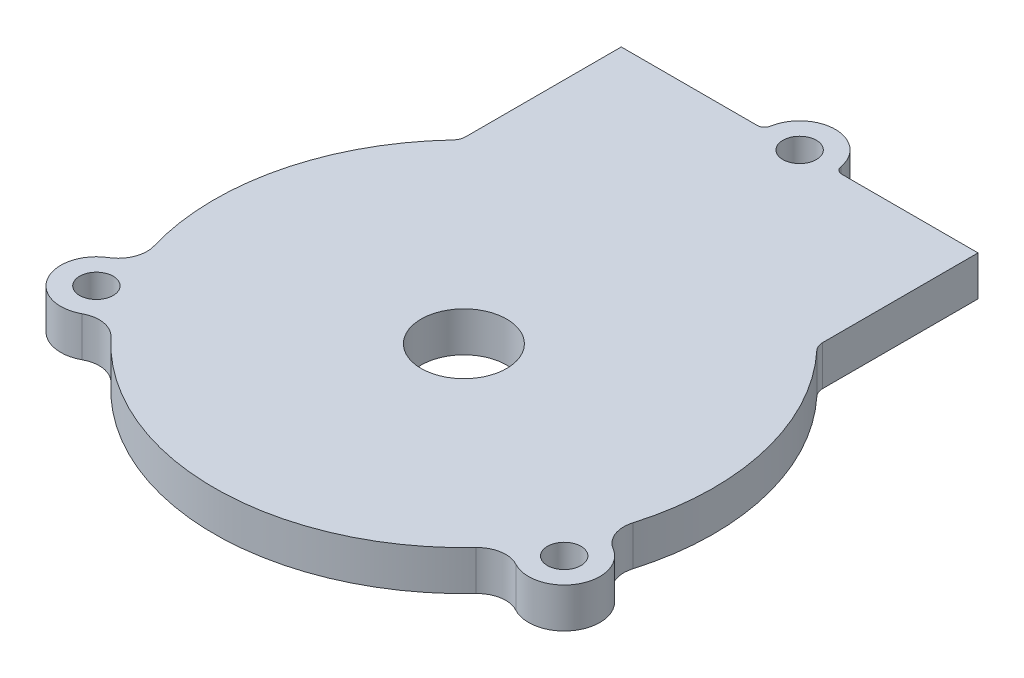
ISO-10303-21;
HEADER;
FILE_DESCRIPTION(('STEP AP214'),'2;1');
FILE_NAME('part.step','',(''),(''),'','','');
FILE_SCHEMA(('AUTOMOTIVE_DESIGN { 1 0 10303 214 1 1 1 1 }'));
ENDSEC;
DATA;
#1=APPLICATION_CONTEXT('core data for automotive mechanical design processes');
#2=APPLICATION_PROTOCOL_DEFINITION('international standard','automotive_design',2000,#1);
#3=PRODUCT_CONTEXT('',#1,'mechanical');
#4=PRODUCT('Part','Part','',(#3));
#5=PRODUCT_RELATED_PRODUCT_CATEGORY('part','',(#4));
#6=PRODUCT_DEFINITION_FORMATION('','',#4);
#7=PRODUCT_DEFINITION_CONTEXT('part definition',#1,'design');
#8=PRODUCT_DEFINITION('design','',#6,#7);
#9=PRODUCT_DEFINITION_SHAPE('','',#8);
#10=(LENGTH_UNIT() NAMED_UNIT(*) SI_UNIT(.MILLI.,.METRE.));
#11=(NAMED_UNIT(*) PLANE_ANGLE_UNIT() SI_UNIT($,.RADIAN.));
#12=(NAMED_UNIT(*) SI_UNIT($,.STERADIAN.) SOLID_ANGLE_UNIT());
#13=UNCERTAINTY_MEASURE_WITH_UNIT(LENGTH_MEASURE(1.E-05),#10,'distance_accuracy_value','');
#14=(GEOMETRIC_REPRESENTATION_CONTEXT(3) GLOBAL_UNCERTAINTY_ASSIGNED_CONTEXT((#13)) GLOBAL_UNIT_ASSIGNED_CONTEXT((#10,
#11,#12)) REPRESENTATION_CONTEXT('',''));
#15=CARTESIAN_POINT('',(0.,0.,0.));
#16=DIRECTION('',(0.,0.,1.));
#17=DIRECTION('',(1.,0.,0.));
#18=AXIS2_PLACEMENT_3D('',#15,#16,#17);
#19=CARTESIAN_POINT('',(65.57,5.588,0.));
#20=DIRECTION('',(0.,-1.,0.));
#21=DIRECTION('',(0.,0.,-1.));
#22=AXIS2_PLACEMENT_3D('',#19,#20,#21);
#23=CYLINDRICAL_SURFACE('',#22,5.);
#24=CARTESIAN_POINT('',(65.57,0.,0.));
#25=DIRECTION('',(0.,1.,0.));
#26=DIRECTION('',(0.,0.,1.));
#27=AXIS2_PLACEMENT_3D('',#24,#25,#26);
#28=CIRCLE('',#27,5.);
#29=CARTESIAN_POINT('',(63.1837861753871,0.,4.39385748326303));
#30=VERTEX_POINT('',#29);
#31=CARTESIAN_POINT('',(68.1420487128526,0.,-4.28772263780124));
#32=VERTEX_POINT('',#31);
#33=EDGE_CURVE('E570',#30,#32,#28,.T.);
#34=ORIENTED_EDGE('',*,*,#33,.T.);
#35=DIRECTION('',(0.,-1.,0.));
#36=VECTOR('',#35,1.);
#37=CARTESIAN_POINT('',(68.1420487128526,5.588,-4.28772263780124));
#38=LINE('',#37,#36);
#39=CARTESIAN_POINT('',(68.1420487128526,5.588,-4.28772263780124));
#40=VERTEX_POINT('',#39);
#41=EDGE_CURVE('E282',#32,#40,#38,.F.);
#42=ORIENTED_EDGE('',*,*,#41,.T.);
#43=CARTESIAN_POINT('',(65.57,5.588,0.));
#44=DIRECTION('',(0.,1.,0.));
#45=DIRECTION('',(0.,0.,1.));
#46=AXIS2_PLACEMENT_3D('',#43,#44,#45);
#47=CIRCLE('',#46,5.);
#48=CARTESIAN_POINT('',(63.1837861753871,5.588,4.39385748326303));
#49=VERTEX_POINT('',#48);
#50=EDGE_CURVE('E242',#49,#40,#47,.T.);
#51=ORIENTED_EDGE('',*,*,#50,.F.);
#52=DIRECTION('',(0.,-1.,0.));
#53=VECTOR('',#52,1.);
#54=CARTESIAN_POINT('',(63.1837861753871,5.588,4.39385748326303));
#55=LINE('',#54,#53);
#56=EDGE_CURVE('E280',#49,#30,#55,.T.);
#57=ORIENTED_EDGE('',*,*,#56,.T.);
#58=EDGE_LOOP('',(#34,#42,#51,#57));
#59=FACE_BOUND('',#58,.T.);
#60=ADVANCED_FACE('F81',(#59),#23,.T.);
#61=CARTESIAN_POINT('',(65.57,0.,0.));
#62=DIRECTION('',(0.,1.,0.));
#63=DIRECTION('',(0.,0.,1.));
#64=AXIS2_PLACEMENT_3D('',#61,#62,#63);
#65=PLANE('',#64);
#66=CARTESIAN_POINT('',(0.,0.,0.));
#67=DIRECTION('',(0.,1.,0.));
#68=DIRECTION('',(0.,0.,1.));
#69=AXIS2_PLACEMENT_3D('',#66,#67,#68);
#70=CIRCLE('',#69,2.35);
#71=CARTESIAN_POINT('',(0.,0.,2.35));
#72=VERTEX_POINT('',#71);
#73=EDGE_CURVE('E593',#72,#72,#70,.T.);
#74=ORIENTED_EDGE('',*,*,#73,.T.);
#75=EDGE_LOOP('',(#74));
#76=FACE_BOUND('',#75,.T.);
#77=CARTESIAN_POINT('',(65.57,0.,0.));
#78=DIRECTION('',(0.,1.,0.));
#79=DIRECTION('',(0.,0.,1.));
#80=AXIS2_PLACEMENT_3D('',#77,#78,#79);
#81=CIRCLE('',#80,2.35);
#82=CARTESIAN_POINT('',(65.57,0.,2.35));
#83=VERTEX_POINT('',#82);
#84=EDGE_CURVE('E587',#83,#83,#81,.T.);
#85=ORIENTED_EDGE('',*,*,#84,.T.);
#86=EDGE_LOOP('',(#85));
#87=FACE_BOUND('',#86,.T.);
#88=CARTESIAN_POINT('',(32.785,0.,-65.7829292065958));
#89=DIRECTION('',(0.,1.,0.));
#90=DIRECTION('',(0.,0.,1.));
#91=AXIS2_PLACEMENT_3D('',#88,#89,#90);
#92=CIRCLE('',#91,2.35);
#93=CARTESIAN_POINT('',(32.785,0.,-63.4329292065959));
#94=VERTEX_POINT('',#93);
#95=EDGE_CURVE('E581',#94,#94,#92,.T.);
#96=ORIENTED_EDGE('',*,*,#95,.T.);
#97=EDGE_LOOP('',(#96));
#98=FACE_BOUND('',#97,.T.);
#99=CARTESIAN_POINT('',(32.785,0.,-18.72431458605));
#100=DIRECTION('',(0.,1.,0.));
#101=DIRECTION('',(0.,0.,1.));
#102=AXIS2_PLACEMENT_3D('',#99,#100,#101);
#103=CIRCLE('',#102,35.);
#104=CARTESIAN_POINT('',(7.24445945945945,0.,-42.6550644467837));
#105=VERTEX_POINT('',#104);
#106=CARTESIAN_POINT('',(-0.792283818197827,0.,-8.8467637057866));
#107=VERTEX_POINT('',#106);
#108=EDGE_CURVE('E326',#105,#107,#103,.T.);
#109=ORIENTED_EDGE('',*,*,#108,.F.);
#110=CARTESIAN_POINT('',(5.78499999999999,0.,-44.0225358673971));
#111=DIRECTION('',(0.,1.,0.));
#112=DIRECTION('',(0.,0.,1.));
#113=AXIS2_PLACEMENT_3D('',#110,#111,#112);
#114=CIRCLE('',#113,2.);
#115=CARTESIAN_POINT('',(7.785,0.,-44.0225358673971));
#116=VERTEX_POINT('',#115);
#117=EDGE_CURVE('E12',#105,#116,#114,.T.);
#118=ORIENTED_EDGE('',*,*,#117,.T.);
#119=DIRECTION('',(0.,0.,1.));
#120=VECTOR('',#119,1.);
#121=CARTESIAN_POINT('',(7.78499999999999,0.,-65.7829292065958));
#122=LINE('',#121,#120);
#123=CARTESIAN_POINT('',(7.78499999999999,0.,-65.7829292065958));
#124=VERTEX_POINT('',#123);
#125=EDGE_CURVE('E340',#124,#116,#122,.T.);
#126=ORIENTED_EDGE('',*,*,#125,.F.);
#127=DIRECTION('',(-1.,0.,0.));
#128=VECTOR('',#127,1.);
#129=CARTESIAN_POINT('',(57.785,0.,-65.7829292065958));
#130=LINE('',#129,#128);
#131=CARTESIAN_POINT('',(26.8689202169004,0.,-65.7829292065958));
#132=VERTEX_POINT('',#131);
#133=EDGE_CURVE('E229',#132,#124,#130,.T.);
#134=ORIENTED_EDGE('',*,*,#133,.F.);
#135=CARTESIAN_POINT('',(26.8689202169004,0.,-66.7829292065958));
#136=DIRECTION('',(0.,1.,0.));
#137=DIRECTION('',(0.,0.,1.));
#138=AXIS2_PLACEMENT_3D('',#135,#136,#137);
#139=CIRCLE('',#138,1.);
#140=CARTESIAN_POINT('',(27.8549335140836,0.,-66.6162625399292));
#141=VERTEX_POINT('',#140);
#142=EDGE_CURVE('E245',#132,#141,#139,.T.);
#143=ORIENTED_EDGE('',*,*,#142,.T.);
#144=CARTESIAN_POINT('',(32.785,0.,-65.7829292065958));
#145=DIRECTION('',(0.,1.,0.));
#146=DIRECTION('',(0.,0.,1.));
#147=AXIS2_PLACEMENT_3D('',#144,#145,#146);
#148=CIRCLE('',#147,5.);
#149=CARTESIAN_POINT('',(37.7150664859163,0.,-66.6162625399292));
#150=VERTEX_POINT('',#149);
#151=EDGE_CURVE('E231',#150,#141,#148,.T.);
#152=ORIENTED_EDGE('',*,*,#151,.F.);
#153=CARTESIAN_POINT('',(38.7010797830996,0.,-66.7829292065958));
#154=DIRECTION('',(0.,1.,0.));
#155=DIRECTION('',(0.,0.,1.));
#156=AXIS2_PLACEMENT_3D('',#153,#154,#155);
#157=CIRCLE('',#156,1.);
#158=CARTESIAN_POINT('',(38.7010797830996,0.,-65.7829292065958));
#159=VERTEX_POINT('',#158);
#160=EDGE_CURVE('E256',#150,#159,#157,.T.);
#161=ORIENTED_EDGE('',*,*,#160,.T.);
#162=CARTESIAN_POINT('',(57.785,0.,-65.7829292065958));
#163=VERTEX_POINT('',#162);
#164=EDGE_CURVE('E337',#163,#159,#130,.T.);
#165=ORIENTED_EDGE('',*,*,#164,.F.);
#166=DIRECTION('',(0.,0.,1.));
#167=VECTOR('',#166,1.);
#168=CARTESIAN_POINT('',(57.785,0.,-65.7829292065958));
#169=LINE('',#168,#167);
#170=CARTESIAN_POINT('',(57.785,0.,-44.0225358673971));
#171=VERTEX_POINT('',#170);
#172=EDGE_CURVE('E215',#163,#171,#169,.T.);
#173=ORIENTED_EDGE('',*,*,#172,.T.);
#174=CARTESIAN_POINT('',(59.785,0.,-44.0225358673971));
#175=DIRECTION('',(0.,1.,0.));
#176=DIRECTION('',(0.,0.,1.));
#177=AXIS2_PLACEMENT_3D('',#174,#175,#176);
#178=CIRCLE('',#177,2.);
#179=CARTESIAN_POINT('',(58.3255405405405,0.,-42.6550644467837));
#180=VERTEX_POINT('',#179);
#181=EDGE_CURVE('E302',#171,#180,#178,.T.);
#182=ORIENTED_EDGE('',*,*,#181,.T.);
#183=CARTESIAN_POINT('',(66.3622838181978,0.,-8.8467637057866));
#184=VERTEX_POINT('',#183);
#185=EDGE_CURVE('E312',#184,#180,#103,.T.);
#186=ORIENTED_EDGE('',*,*,#185,.F.);
#187=CARTESIAN_POINT('',(70.1996876831347,0.,-7.71790074804221));
#188=DIRECTION('',(0.,1.,0.));
#189=DIRECTION('',(0.,0.,1.));
#190=AXIS2_PLACEMENT_3D('',#187,#188,#189);
#191=CIRCLE('',#190,4.);
#192=EDGE_CURVE('E287',#184,#32,#191,.T.);
#193=ORIENTED_EDGE('',*,*,#192,.T.);
#194=ORIENTED_EDGE('',*,*,#33,.F.);
#195=CARTESIAN_POINT('',(61.2748151156969,0.,7.90894346987345));
#196=DIRECTION('',(0.,1.,0.));
#197=DIRECTION('',(0.,0.,1.));
#198=AXIS2_PLACEMENT_3D('',#195,#196,#197);
#199=CIRCLE('',#198,4.);
#200=CARTESIAN_POINT('',(58.3527827961382,0.,5.17732725900951));
#201=VERTEX_POINT('',#200);
#202=EDGE_CURVE('E293',#30,#201,#199,.T.);
#203=ORIENTED_EDGE('',*,*,#202,.T.);
#204=CARTESIAN_POINT('',(7.21721720386177,0.,5.17732725900951));
#205=VERTEX_POINT('',#204);
#206=EDGE_CURVE('E323',#205,#201,#103,.T.);
#207=ORIENTED_EDGE('',*,*,#206,.F.);
#208=CARTESIAN_POINT('',(4.29518488430312,0.,7.90894346987345));
#209=DIRECTION('',(0.,1.,0.));
#210=DIRECTION('',(0.,0.,1.));
#211=AXIS2_PLACEMENT_3D('',#208,#209,#210);
#212=CIRCLE('',#211,4.);
#213=CARTESIAN_POINT('',(2.38621382461284,0.,4.39385748326303));
#214=VERTEX_POINT('',#213);
#215=EDGE_CURVE('E273',#205,#214,#212,.T.);
#216=ORIENTED_EDGE('',*,*,#215,.T.);
#217=CARTESIAN_POINT('',(0.,0.,0.));
#218=DIRECTION('',(0.,1.,0.));
#219=DIRECTION('',(0.,0.,1.));
#220=AXIS2_PLACEMENT_3D('',#217,#218,#219);
#221=CIRCLE('',#220,5.);
#222=CARTESIAN_POINT('',(-2.57204871285262,0.,-4.28772263780123));
#223=VERTEX_POINT('',#222);
#224=EDGE_CURVE('E556',#223,#214,#221,.T.);
#225=ORIENTED_EDGE('',*,*,#224,.F.);
#226=CARTESIAN_POINT('',(-4.62968768313471,0.,-7.71790074804221));
#227=DIRECTION('',(0.,1.,0.));
#228=DIRECTION('',(0.,0.,1.));
#229=AXIS2_PLACEMENT_3D('',#226,#227,#228);
#230=CIRCLE('',#229,4.);
#231=EDGE_CURVE('E265',#223,#107,#230,.T.);
#232=ORIENTED_EDGE('',*,*,#231,.T.);
#233=EDGE_LOOP('',(#109,#118,#126,#134,#143,#152,#161,#165,#173,#182,#186,#193,#194,#203,#207,
#216,#225,#232));
#234=FACE_BOUND('',#233,.T.);
#235=CARTESIAN_POINT('',(32.785,0.,-18.72431458605));
#236=DIRECTION('',(0.,1.,0.));
#237=DIRECTION('',(0.,0.,1.));
#238=AXIS2_PLACEMENT_3D('',#235,#236,#237);
#239=CIRCLE('',#238,6.);
#240=CARTESIAN_POINT('',(32.785,0.,-12.72431458605));
#241=VERTEX_POINT('',#240);
#242=EDGE_CURVE('E352',#241,#241,#239,.T.);
#243=ORIENTED_EDGE('',*,*,#242,.T.);
#244=EDGE_LOOP('',(#243));
#245=FACE_BOUND('',#244,.T.);
#246=ADVANCED_FACE('F310',(#76,#87,#98,#234,#245),#65,.F.);
#247=CARTESIAN_POINT('',(65.57,5.588,0.));
#248=DIRECTION('',(0.,1.,0.));
#249=DIRECTION('',(0.,0.,1.));
#250=AXIS2_PLACEMENT_3D('',#247,#248,#249);
#251=PLANE('',#250);
#252=CARTESIAN_POINT('',(0.,5.588,0.));
#253=DIRECTION('',(0.,1.,0.));
#254=DIRECTION('',(0.,0.,1.));
#255=AXIS2_PLACEMENT_3D('',#252,#253,#254);
#256=CIRCLE('',#255,2.35);
#257=CARTESIAN_POINT('',(0.,5.588,2.35));
#258=VERTEX_POINT('',#257);
#259=EDGE_CURVE('E596',#258,#258,#256,.T.);
#260=ORIENTED_EDGE('',*,*,#259,.F.);
#261=EDGE_LOOP('',(#260));
#262=FACE_BOUND('',#261,.T.);
#263=CARTESIAN_POINT('',(65.57,5.588,0.));
#264=DIRECTION('',(0.,1.,0.));
#265=DIRECTION('',(0.,0.,1.));
#266=AXIS2_PLACEMENT_3D('',#263,#264,#265);
#267=CIRCLE('',#266,2.35);
#268=CARTESIAN_POINT('',(65.57,5.588,2.35));
#269=VERTEX_POINT('',#268);
#270=EDGE_CURVE('E590',#269,#269,#267,.T.);
#271=ORIENTED_EDGE('',*,*,#270,.F.);
#272=EDGE_LOOP('',(#271));
#273=FACE_BOUND('',#272,.T.);
#274=CARTESIAN_POINT('',(32.785,5.588,-65.7829292065958));
#275=DIRECTION('',(0.,1.,0.));
#276=DIRECTION('',(0.,0.,1.));
#277=AXIS2_PLACEMENT_3D('',#274,#275,#276);
#278=CIRCLE('',#277,2.35);
#279=CARTESIAN_POINT('',(32.785,5.588,-63.4329292065959));
#280=VERTEX_POINT('',#279);
#281=EDGE_CURVE('E584',#280,#280,#278,.T.);
#282=ORIENTED_EDGE('',*,*,#281,.F.);
#283=EDGE_LOOP('',(#282));
#284=FACE_BOUND('',#283,.T.);
#285=CARTESIAN_POINT('',(32.785,5.588,-18.72431458605));
#286=DIRECTION('',(0.,1.,0.));
#287=DIRECTION('',(0.,0.,1.));
#288=AXIS2_PLACEMENT_3D('',#285,#286,#287);
#289=CIRCLE('',#288,35.);
#290=CARTESIAN_POINT('',(7.21721720386177,5.588,5.17732725900951));
#291=VERTEX_POINT('',#290);
#292=CARTESIAN_POINT('',(58.3527827961382,5.588,5.17732725900951));
#293=VERTEX_POINT('',#292);
#294=EDGE_CURVE('E346',#291,#293,#289,.T.);
#295=ORIENTED_EDGE('',*,*,#294,.T.);
#296=CARTESIAN_POINT('',(61.2748151156969,5.588,7.90894346987345));
#297=DIRECTION('',(0.,1.,0.));
#298=DIRECTION('',(0.,0.,1.));
#299=AXIS2_PLACEMENT_3D('',#296,#297,#298);
#300=CIRCLE('',#299,4.);
#301=EDGE_CURVE('E291',#293,#49,#300,.F.);
#302=ORIENTED_EDGE('',*,*,#301,.T.);
#303=ORIENTED_EDGE('',*,*,#50,.T.);
#304=CARTESIAN_POINT('',(70.1996876831347,5.588,-7.71790074804221));
#305=DIRECTION('',(0.,1.,0.));
#306=DIRECTION('',(0.,0.,1.));
#307=AXIS2_PLACEMENT_3D('',#304,#305,#306);
#308=CIRCLE('',#307,4.);
#309=CARTESIAN_POINT('',(66.3622838181978,5.588,-8.8467637057866));
#310=VERTEX_POINT('',#309);
#311=EDGE_CURVE('E289',#40,#310,#308,.F.);
#312=ORIENTED_EDGE('',*,*,#311,.T.);
#313=CARTESIAN_POINT('',(58.3255405405405,5.588,-42.6550644467837));
#314=VERTEX_POINT('',#313);
#315=EDGE_CURVE('E331',#310,#314,#289,.T.);
#316=ORIENTED_EDGE('',*,*,#315,.T.);
#317=CARTESIAN_POINT('',(59.785,5.588,-44.0225358673971));
#318=DIRECTION('',(0.,1.,0.));
#319=DIRECTION('',(0.,0.,1.));
#320=AXIS2_PLACEMENT_3D('',#317,#318,#319);
#321=CIRCLE('',#320,2.);
#322=CARTESIAN_POINT('',(57.785,5.588,-44.0225358673971));
#323=VERTEX_POINT('',#322);
#324=EDGE_CURVE('E300',#314,#323,#321,.F.);
#325=ORIENTED_EDGE('',*,*,#324,.T.);
#326=DIRECTION('',(0.,0.,1.));
#327=VECTOR('',#326,1.);
#328=CARTESIAN_POINT('',(57.785,5.588,-65.7829292065958));
#329=LINE('',#328,#327);
#330=CARTESIAN_POINT('',(57.785,5.588,-65.7829292065958));
#331=VERTEX_POINT('',#330);
#332=EDGE_CURVE('E225',#331,#323,#329,.T.);
#333=ORIENTED_EDGE('',*,*,#332,.F.);
#334=DIRECTION('',(-1.,0.,0.));
#335=VECTOR('',#334,1.);
#336=CARTESIAN_POINT('',(57.785,5.588,-65.7829292065958));
#337=LINE('',#336,#335);
#338=CARTESIAN_POINT('',(38.7010797830996,5.588,-65.7829292065958));
#339=VERTEX_POINT('',#338);
#340=EDGE_CURVE('E214',#331,#339,#337,.T.);
#341=ORIENTED_EDGE('',*,*,#340,.T.);
#342=CARTESIAN_POINT('',(38.7010797830996,5.588,-66.7829292065958));
#343=DIRECTION('',(0.,1.,0.));
#344=DIRECTION('',(0.,0.,1.));
#345=AXIS2_PLACEMENT_3D('',#342,#343,#344);
#346=CIRCLE('',#345,1.);
#347=CARTESIAN_POINT('',(37.7150664859163,5.588,-66.6162625399292));
#348=VERTEX_POINT('',#347);
#349=EDGE_CURVE('E254',#339,#348,#346,.F.);
#350=ORIENTED_EDGE('',*,*,#349,.T.);
#351=CARTESIAN_POINT('',(32.785,5.588,-65.7829292065958));
#352=DIRECTION('',(0.,1.,0.));
#353=DIRECTION('',(0.,0.,1.));
#354=AXIS2_PLACEMENT_3D('',#351,#352,#353);
#355=CIRCLE('',#354,5.);
#356=CARTESIAN_POINT('',(27.8549335140836,5.588,-66.6162625399292));
#357=VERTEX_POINT('',#356);
#358=EDGE_CURVE('E234',#348,#357,#355,.T.);
#359=ORIENTED_EDGE('',*,*,#358,.T.);
#360=CARTESIAN_POINT('',(26.8689202169004,5.588,-66.7829292065958));
#361=DIRECTION('',(0.,1.,0.));
#362=DIRECTION('',(0.,0.,1.));
#363=AXIS2_PLACEMENT_3D('',#360,#361,#362);
#364=CIRCLE('',#363,1.);
#365=CARTESIAN_POINT('',(26.8689202169004,5.588,-65.7829292065958));
#366=VERTEX_POINT('',#365);
#367=EDGE_CURVE('E209',#357,#366,#364,.F.);
#368=ORIENTED_EDGE('',*,*,#367,.T.);
#369=CARTESIAN_POINT('',(7.78499999999999,5.588,-65.7829292065958));
#370=VERTEX_POINT('',#369);
#371=EDGE_CURVE('E202',#366,#370,#337,.T.);
#372=ORIENTED_EDGE('',*,*,#371,.T.);
#373=DIRECTION('',(0.,0.,1.));
#374=VECTOR('',#373,1.);
#375=CARTESIAN_POINT('',(7.78499999999999,5.588,-65.7829292065958));
#376=LINE('',#375,#374);
#377=CARTESIAN_POINT('',(7.785,5.588,-44.0225358673971));
#378=VERTEX_POINT('',#377);
#379=EDGE_CURVE('E207',#370,#378,#376,.T.);
#380=ORIENTED_EDGE('',*,*,#379,.T.);
#381=CARTESIAN_POINT('',(5.78499999999999,5.588,-44.0225358673971));
#382=DIRECTION('',(0.,1.,0.));
#383=DIRECTION('',(0.,0.,1.));
#384=AXIS2_PLACEMENT_3D('',#381,#382,#383);
#385=CIRCLE('',#384,2.);
#386=CARTESIAN_POINT('',(7.24445945945945,5.588,-42.6550644467837));
#387=VERTEX_POINT('',#386);
#388=EDGE_CURVE('E89',#378,#387,#385,.F.);
#389=ORIENTED_EDGE('',*,*,#388,.T.);
#390=CARTESIAN_POINT('',(-0.792283818197827,5.588,-8.8467637057866));
#391=VERTEX_POINT('',#390);
#392=EDGE_CURVE('E348',#387,#391,#289,.T.);
#393=ORIENTED_EDGE('',*,*,#392,.T.);
#394=CARTESIAN_POINT('',(-4.62968768313471,5.588,-7.71790074804221));
#395=DIRECTION('',(0.,1.,0.));
#396=DIRECTION('',(0.,0.,1.));
#397=AXIS2_PLACEMENT_3D('',#394,#395,#396);
#398=CIRCLE('',#397,4.);
#399=CARTESIAN_POINT('',(-2.57204871285262,5.588,-4.28772263780123));
#400=VERTEX_POINT('',#399);
#401=EDGE_CURVE('E263',#391,#400,#398,.F.);
#402=ORIENTED_EDGE('',*,*,#401,.T.);
#403=CARTESIAN_POINT('',(0.,5.588,0.));
#404=DIRECTION('',(0.,1.,0.));
#405=DIRECTION('',(0.,0.,1.));
#406=AXIS2_PLACEMENT_3D('',#403,#404,#405);
#407=CIRCLE('',#406,5.);
#408=CARTESIAN_POINT('',(2.38621382461284,5.588,4.39385748326303));
#409=VERTEX_POINT('',#408);
#410=EDGE_CURVE('E558',#400,#409,#407,.T.);
#411=ORIENTED_EDGE('',*,*,#410,.T.);
#412=CARTESIAN_POINT('',(4.29518488430312,5.588,7.90894346987345));
#413=DIRECTION('',(0.,1.,0.));
#414=DIRECTION('',(0.,0.,1.));
#415=AXIS2_PLACEMENT_3D('',#412,#413,#414);
#416=CIRCLE('',#415,4.);
#417=EDGE_CURVE('E275',#409,#291,#416,.F.);
#418=ORIENTED_EDGE('',*,*,#417,.T.);
#419=EDGE_LOOP('',(#295,#302,#303,#312,#316,#325,#333,#341,#350,#359,#368,#372,#380,#389,#393,
#402,#411,#418));
#420=FACE_BOUND('',#419,.T.);
#421=CARTESIAN_POINT('',(32.785,5.588,-18.72431458605));
#422=DIRECTION('',(0.,1.,0.));
#423=DIRECTION('',(0.,0.,1.));
#424=AXIS2_PLACEMENT_3D('',#421,#422,#423);
#425=CIRCLE('',#424,6.);
#426=CARTESIAN_POINT('',(32.785,5.588,-12.72431458605));
#427=VERTEX_POINT('',#426);
#428=EDGE_CURVE('E324',#427,#427,#425,.T.);
#429=ORIENTED_EDGE('',*,*,#428,.F.);
#430=EDGE_LOOP('',(#429));
#431=FACE_BOUND('',#430,.T.);
#432=ADVANCED_FACE('F205',(#262,#273,#284,#420,#431),#251,.T.);
#433=CARTESIAN_POINT('',(32.785,5.588,-65.7829292065958));
#434=DIRECTION('',(0.,-1.,0.));
#435=DIRECTION('',(0.,0.,-1.));
#436=AXIS2_PLACEMENT_3D('',#433,#434,#435);
#437=CYLINDRICAL_SURFACE('',#436,5.);
#438=ORIENTED_EDGE('',*,*,#358,.F.);
#439=DIRECTION('',(0.,-1.,0.));
#440=VECTOR('',#439,1.);
#441=CARTESIAN_POINT('',(37.7150664859163,5.588,-66.6162625399292));
#442=LINE('',#441,#440);
#443=EDGE_CURVE('E252',#348,#150,#442,.T.);
#444=ORIENTED_EDGE('',*,*,#443,.T.);
#445=ORIENTED_EDGE('',*,*,#151,.T.);
#446=DIRECTION('',(0.,-1.,0.));
#447=VECTOR('',#446,1.);
#448=CARTESIAN_POINT('',(27.8549335140836,5.588,-66.6162625399292));
#449=LINE('',#448,#447);
#450=EDGE_CURVE('E241',#141,#357,#449,.F.);
#451=ORIENTED_EDGE('',*,*,#450,.T.);
#452=EDGE_LOOP('',(#438,#444,#445,#451));
#453=FACE_BOUND('',#452,.T.);
#454=ADVANCED_FACE('F363',(#453),#437,.T.);
#455=CARTESIAN_POINT('',(57.785,5.588,-65.7829292065958));
#456=DIRECTION('',(0.,0.,1.));
#457=DIRECTION('',(1.,0.,0.));
#458=AXIS2_PLACEMENT_3D('',#455,#456,#457);
#459=PLANE('',#458);
#460=ORIENTED_EDGE('',*,*,#371,.F.);
#461=DIRECTION('',(0.,1.,0.));
#462=VECTOR('',#461,1.);
#463=CARTESIAN_POINT('',(26.8689202169004,0.,-65.7829292065958));
#464=LINE('',#463,#462);
#465=EDGE_CURVE('E239',#366,#132,#464,.F.);
#466=ORIENTED_EDGE('',*,*,#465,.T.);
#467=ORIENTED_EDGE('',*,*,#133,.T.);
#468=DIRECTION('',(0.,-1.,0.));
#469=VECTOR('',#468,1.);
#470=CARTESIAN_POINT('',(7.78499999999999,5.588,-65.7829292065958));
#471=LINE('',#470,#469);
#472=EDGE_CURVE('E222',#370,#124,#471,.T.);
#473=ORIENTED_EDGE('',*,*,#472,.F.);
#474=EDGE_LOOP('',(#460,#466,#467,#473));
#475=FACE_BOUND('',#474,.T.);
#476=ADVANCED_FACE('F227',(#475),#459,.F.);
#477=ORIENTED_EDGE('',*,*,#164,.T.);
#478=DIRECTION('',(0.,1.,0.));
#479=VECTOR('',#478,1.);
#480=CARTESIAN_POINT('',(38.7010797830996,5.588,-65.7829292065958));
#481=LINE('',#480,#479);
#482=EDGE_CURVE('E249',#159,#339,#481,.T.);
#483=ORIENTED_EDGE('',*,*,#482,.T.);
#484=ORIENTED_EDGE('',*,*,#340,.F.);
#485=DIRECTION('',(0.,-1.,0.));
#486=VECTOR('',#485,1.);
#487=CARTESIAN_POINT('',(57.785,5.588,-65.7829292065958));
#488=LINE('',#487,#486);
#489=EDGE_CURVE('E232',#331,#163,#488,.T.);
#490=ORIENTED_EDGE('',*,*,#489,.T.);
#491=EDGE_LOOP('',(#477,#483,#484,#490));
#492=FACE_BOUND('',#491,.T.);
#493=ADVANCED_FACE('F355',(#492),#459,.F.);
#494=CARTESIAN_POINT('',(7.78499999999999,5.588,-65.7829292065958));
#495=DIRECTION('',(1.,0.,0.));
#496=DIRECTION('',(0.,0.,-1.));
#497=AXIS2_PLACEMENT_3D('',#494,#495,#496);
#498=PLANE('',#497);
#499=ORIENTED_EDGE('',*,*,#125,.T.);
#500=DIRECTION('',(0.,1.,0.));
#501=VECTOR('',#500,1.);
#502=CARTESIAN_POINT('',(7.785,5.588,-44.0225358673971));
#503=LINE('',#502,#501);
#504=EDGE_CURVE('E224',#116,#378,#503,.T.);
#505=ORIENTED_EDGE('',*,*,#504,.T.);
#506=ORIENTED_EDGE('',*,*,#379,.F.);
#507=ORIENTED_EDGE('',*,*,#472,.T.);
#508=EDGE_LOOP('',(#499,#505,#506,#507));
#509=FACE_BOUND('',#508,.T.);
#510=ADVANCED_FACE('F221',(#509),#498,.F.);
#511=CARTESIAN_POINT('',(57.785,5.588,-65.7829292065958));
#512=DIRECTION('',(1.,0.,0.));
#513=DIRECTION('',(0.,0.,-1.));
#514=AXIS2_PLACEMENT_3D('',#511,#512,#513);
#515=PLANE('',#514);
#516=ORIENTED_EDGE('',*,*,#332,.T.);
#517=DIRECTION('',(0.,-1.,0.));
#518=VECTOR('',#517,1.);
#519=CARTESIAN_POINT('',(57.785,5.588,-44.0225358673971));
#520=LINE('',#519,#518);
#521=EDGE_CURVE('E298',#323,#171,#520,.T.);
#522=ORIENTED_EDGE('',*,*,#521,.T.);
#523=ORIENTED_EDGE('',*,*,#172,.F.);
#524=ORIENTED_EDGE('',*,*,#489,.F.);
#525=EDGE_LOOP('',(#516,#522,#523,#524));
#526=FACE_BOUND('',#525,.T.);
#527=ADVANCED_FACE('F333',(#526),#515,.T.);
#528=CARTESIAN_POINT('',(0.,5.588,0.));
#529=DIRECTION('',(0.,-1.,0.));
#530=DIRECTION('',(0.,0.,-1.));
#531=AXIS2_PLACEMENT_3D('',#528,#529,#530);
#532=CYLINDRICAL_SURFACE('',#531,5.);
#533=ORIENTED_EDGE('',*,*,#224,.T.);
#534=DIRECTION('',(0.,-1.,0.));
#535=VECTOR('',#534,1.);
#536=CARTESIAN_POINT('',(2.38621382461284,5.588,4.39385748326303));
#537=LINE('',#536,#535);
#538=EDGE_CURVE('E271',#214,#409,#537,.F.);
#539=ORIENTED_EDGE('',*,*,#538,.T.);
#540=ORIENTED_EDGE('',*,*,#410,.F.);
#541=DIRECTION('',(0.,-1.,0.));
#542=VECTOR('',#541,1.);
#543=CARTESIAN_POINT('',(-2.57204871285262,5.588,-4.28772263780123));
#544=LINE('',#543,#542);
#545=EDGE_CURVE('E261',#400,#223,#544,.T.);
#546=ORIENTED_EDGE('',*,*,#545,.T.);
#547=EDGE_LOOP('',(#533,#539,#540,#546));
#548=FACE_BOUND('',#547,.T.);
#549=ADVANCED_FACE('F391',(#548),#532,.T.);
#550=CARTESIAN_POINT('',(32.785,5.588,-18.72431458605));
#551=DIRECTION('',(0.,-1.,0.));
#552=DIRECTION('',(0.,0.,-1.));
#553=AXIS2_PLACEMENT_3D('',#550,#551,#552);
#554=CYLINDRICAL_SURFACE('',#553,35.);
#555=ORIENTED_EDGE('',*,*,#392,.F.);
#556=DIRECTION('',(0.,-1.,0.));
#557=VECTOR('',#556,1.);
#558=CARTESIAN_POINT('',(7.24445945945945,5.588,-42.6550644467837));
#559=LINE('',#558,#557);
#560=EDGE_CURVE('E102',#387,#105,#559,.T.);
#561=ORIENTED_EDGE('',*,*,#560,.T.);
#562=ORIENTED_EDGE('',*,*,#108,.T.);
#563=DIRECTION('',(0.,-1.,0.));
#564=VECTOR('',#563,1.);
#565=CARTESIAN_POINT('',(-0.792283818197827,5.588,-8.8467637057866));
#566=LINE('',#565,#564);
#567=EDGE_CURVE('E258',#107,#391,#566,.F.);
#568=ORIENTED_EDGE('',*,*,#567,.T.);
#569=EDGE_LOOP('',(#555,#561,#562,#568));
#570=FACE_BOUND('',#569,.T.);
#571=ADVANCED_FACE('F394',(#570),#554,.T.);
#572=ORIENTED_EDGE('',*,*,#206,.T.);
#573=DIRECTION('',(0.,-1.,0.));
#574=VECTOR('',#573,1.);
#575=CARTESIAN_POINT('',(58.3527827961382,5.588,5.17732725900951));
#576=LINE('',#575,#574);
#577=EDGE_CURVE('E284',#201,#293,#576,.F.);
#578=ORIENTED_EDGE('',*,*,#577,.T.);
#579=ORIENTED_EDGE('',*,*,#294,.F.);
#580=DIRECTION('',(0.,-1.,0.));
#581=VECTOR('',#580,1.);
#582=CARTESIAN_POINT('',(7.21721720386176,5.588,5.17732725900951));
#583=LINE('',#582,#581);
#584=EDGE_CURVE('E268',#291,#205,#583,.T.);
#585=ORIENTED_EDGE('',*,*,#584,.T.);
#586=EDGE_LOOP('',(#572,#578,#579,#585));
#587=FACE_BOUND('',#586,.T.);
#588=ADVANCED_FACE('F396',(#587),#554,.T.);
#589=ORIENTED_EDGE('',*,*,#185,.T.);
#590=DIRECTION('',(0.,-1.,0.));
#591=VECTOR('',#590,1.);
#592=CARTESIAN_POINT('',(58.3255405405405,5.588,-42.6550644467837));
#593=LINE('',#592,#591);
#594=EDGE_CURVE('E295',#180,#314,#593,.F.);
#595=ORIENTED_EDGE('',*,*,#594,.T.);
#596=ORIENTED_EDGE('',*,*,#315,.F.);
#597=DIRECTION('',(0.,-1.,0.));
#598=VECTOR('',#597,1.);
#599=CARTESIAN_POINT('',(66.3622838181978,5.588,-8.8467637057866));
#600=LINE('',#599,#598);
#601=EDGE_CURVE('E277',#310,#184,#600,.T.);
#602=ORIENTED_EDGE('',*,*,#601,.T.);
#603=EDGE_LOOP('',(#589,#595,#596,#602));
#604=FACE_BOUND('',#603,.T.);
#605=ADVANCED_FACE('F319',(#604),#554,.T.);
#606=CARTESIAN_POINT('',(32.785,5.588,-18.72431458605));
#607=DIRECTION('',(0.,-1.,0.));
#608=DIRECTION('',(0.,0.,-1.));
#609=AXIS2_PLACEMENT_3D('',#606,#607,#608);
#610=CYLINDRICAL_SURFACE('',#609,6.);
#611=ORIENTED_EDGE('',*,*,#428,.T.);
#612=EDGE_LOOP('',(#611));
#613=FACE_BOUND('',#612,.T.);
#614=ORIENTED_EDGE('',*,*,#242,.F.);
#615=EDGE_LOOP('',(#614));
#616=FACE_BOUND('',#615,.T.);
#617=ADVANCED_FACE('F397',(#613,#616),#610,.F.);
#618=CARTESIAN_POINT('',(32.785,5.588,-65.7829292065958));
#619=DIRECTION('',(0.,1.,0.));
#620=DIRECTION('',(0.,0.,1.));
#621=AXIS2_PLACEMENT_3D('',#618,#619,#620);
#622=CYLINDRICAL_SURFACE('',#621,2.35);
#623=ORIENTED_EDGE('',*,*,#95,.F.);
#624=EDGE_LOOP('',(#623));
#625=FACE_BOUND('',#624,.T.);
#626=ORIENTED_EDGE('',*,*,#281,.T.);
#627=EDGE_LOOP('',(#626));
#628=FACE_BOUND('',#627,.T.);
#629=ADVANCED_FACE('F400',(#625,#628),#622,.F.);
#630=CARTESIAN_POINT('',(65.57,5.588,0.));
#631=DIRECTION('',(0.,1.,0.));
#632=DIRECTION('',(0.,0.,1.));
#633=AXIS2_PLACEMENT_3D('',#630,#631,#632);
#634=CYLINDRICAL_SURFACE('',#633,2.35);
#635=ORIENTED_EDGE('',*,*,#84,.F.);
#636=EDGE_LOOP('',(#635));
#637=FACE_BOUND('',#636,.T.);
#638=ORIENTED_EDGE('',*,*,#270,.T.);
#639=EDGE_LOOP('',(#638));
#640=FACE_BOUND('',#639,.T.);
#641=ADVANCED_FACE('F376',(#637,#640),#634,.F.);
#642=CARTESIAN_POINT('',(0.,5.588,0.));
#643=DIRECTION('',(0.,1.,0.));
#644=DIRECTION('',(0.,0.,1.));
#645=AXIS2_PLACEMENT_3D('',#642,#643,#644);
#646=CYLINDRICAL_SURFACE('',#645,2.35);
#647=ORIENTED_EDGE('',*,*,#73,.F.);
#648=EDGE_LOOP('',(#647));
#649=FACE_BOUND('',#648,.T.);
#650=ORIENTED_EDGE('',*,*,#259,.T.);
#651=EDGE_LOOP('',(#650));
#652=FACE_BOUND('',#651,.T.);
#653=ADVANCED_FACE('F368',(#649,#652),#646,.F.);
#654=CARTESIAN_POINT('',(26.8689202169004,5.588,-66.7829292065958));
#655=DIRECTION('',(0.,-1.,0.));
#656=DIRECTION('',(0.,0.,-1.));
#657=AXIS2_PLACEMENT_3D('',#654,#655,#656);
#658=CYLINDRICAL_SURFACE('',#657,1.);
#659=ORIENTED_EDGE('',*,*,#367,.F.);
#660=ORIENTED_EDGE('',*,*,#450,.F.);
#661=ORIENTED_EDGE('',*,*,#142,.F.);
#662=ORIENTED_EDGE('',*,*,#465,.F.);
#663=EDGE_LOOP('',(#659,#660,#661,#662));
#664=FACE_BOUND('',#663,.T.);
#665=ADVANCED_FACE('F366',(#664),#658,.F.);
#666=CARTESIAN_POINT('',(38.7010797830996,5.588,-66.7829292065958));
#667=DIRECTION('',(0.,-1.,0.));
#668=DIRECTION('',(0.,0.,-1.));
#669=AXIS2_PLACEMENT_3D('',#666,#667,#668);
#670=CYLINDRICAL_SURFACE('',#669,1.);
#671=ORIENTED_EDGE('',*,*,#160,.F.);
#672=ORIENTED_EDGE('',*,*,#443,.F.);
#673=ORIENTED_EDGE('',*,*,#349,.F.);
#674=ORIENTED_EDGE('',*,*,#482,.F.);
#675=EDGE_LOOP('',(#671,#672,#673,#674));
#676=FACE_BOUND('',#675,.T.);
#677=ADVANCED_FACE('F359',(#676),#670,.F.);
#678=CARTESIAN_POINT('',(-4.62968768313471,5.588,-7.71790074804221));
#679=DIRECTION('',(0.,-1.,0.));
#680=DIRECTION('',(0.,0.,-1.));
#681=AXIS2_PLACEMENT_3D('',#678,#679,#680);
#682=CYLINDRICAL_SURFACE('',#681,4.);
#683=ORIENTED_EDGE('',*,*,#231,.F.);
#684=ORIENTED_EDGE('',*,*,#545,.F.);
#685=ORIENTED_EDGE('',*,*,#401,.F.);
#686=ORIENTED_EDGE('',*,*,#567,.F.);
#687=EDGE_LOOP('',(#683,#684,#685,#686));
#688=FACE_BOUND('',#687,.T.);
#689=ADVANCED_FACE('F374',(#688),#682,.F.);
#690=CARTESIAN_POINT('',(4.29518488430312,5.588,7.90894346987345));
#691=DIRECTION('',(0.,1.,0.));
#692=DIRECTION('',(0.,0.,1.));
#693=AXIS2_PLACEMENT_3D('',#690,#691,#692);
#694=CYLINDRICAL_SURFACE('',#693,4.);
#695=ORIENTED_EDGE('',*,*,#417,.F.);
#696=ORIENTED_EDGE('',*,*,#538,.F.);
#697=ORIENTED_EDGE('',*,*,#215,.F.);
#698=ORIENTED_EDGE('',*,*,#584,.F.);
#699=EDGE_LOOP('',(#695,#696,#697,#698));
#700=FACE_BOUND('',#699,.T.);
#701=ADVANCED_FACE('F526',(#700),#694,.F.);
#702=CARTESIAN_POINT('',(70.1996876831347,5.588,-7.71790074804221));
#703=DIRECTION('',(0.,1.,0.));
#704=DIRECTION('',(0.,0.,1.));
#705=AXIS2_PLACEMENT_3D('',#702,#703,#704);
#706=CYLINDRICAL_SURFACE('',#705,4.);
#707=ORIENTED_EDGE('',*,*,#311,.F.);
#708=ORIENTED_EDGE('',*,*,#41,.F.);
#709=ORIENTED_EDGE('',*,*,#192,.F.);
#710=ORIENTED_EDGE('',*,*,#601,.F.);
#711=EDGE_LOOP('',(#707,#708,#709,#710));
#712=FACE_BOUND('',#711,.T.);
#713=ADVANCED_FACE('F520',(#712),#706,.F.);
#714=CARTESIAN_POINT('',(61.2748151156969,5.588,7.90894346987345));
#715=DIRECTION('',(0.,-1.,0.));
#716=DIRECTION('',(0.,0.,-1.));
#717=AXIS2_PLACEMENT_3D('',#714,#715,#716);
#718=CYLINDRICAL_SURFACE('',#717,4.);
#719=ORIENTED_EDGE('',*,*,#202,.F.);
#720=ORIENTED_EDGE('',*,*,#56,.F.);
#721=ORIENTED_EDGE('',*,*,#301,.F.);
#722=ORIENTED_EDGE('',*,*,#577,.F.);
#723=EDGE_LOOP('',(#719,#720,#721,#722));
#724=FACE_BOUND('',#723,.T.);
#725=ADVANCED_FACE('F506',(#724),#718,.F.);
#726=CARTESIAN_POINT('',(59.785,5.588,-44.0225358673971));
#727=DIRECTION('',(0.,-1.,0.));
#728=DIRECTION('',(0.,0.,-1.));
#729=AXIS2_PLACEMENT_3D('',#726,#727,#728);
#730=CYLINDRICAL_SURFACE('',#729,2.);
#731=ORIENTED_EDGE('',*,*,#181,.F.);
#732=ORIENTED_EDGE('',*,*,#521,.F.);
#733=ORIENTED_EDGE('',*,*,#324,.F.);
#734=ORIENTED_EDGE('',*,*,#594,.F.);
#735=EDGE_LOOP('',(#731,#732,#733,#734));
#736=FACE_BOUND('',#735,.T.);
#737=ADVANCED_FACE('F327',(#736),#730,.F.);
#738=CARTESIAN_POINT('',(5.78499999999999,5.588,-44.0225358673971));
#739=DIRECTION('',(0.,-1.,0.));
#740=DIRECTION('',(0.,0.,-1.));
#741=AXIS2_PLACEMENT_3D('',#738,#739,#740);
#742=CYLINDRICAL_SURFACE('',#741,2.);
#743=ORIENTED_EDGE('',*,*,#117,.F.);
#744=ORIENTED_EDGE('',*,*,#560,.F.);
#745=ORIENTED_EDGE('',*,*,#388,.F.);
#746=ORIENTED_EDGE('',*,*,#504,.F.);
#747=EDGE_LOOP('',(#743,#744,#745,#746));
#748=FACE_BOUND('',#747,.T.);
#749=ADVANCED_FACE('F83',(#748),#742,.F.);
#750=CLOSED_SHELL('',(#60,#246,#432,#454,#476,#493,#510,#527,#549,#571,#588,#605,#617,#629,#641,
#653,#665,#677,#689,#701,#713,#725,#737,#749));
#751=MANIFOLD_SOLID_BREP('B2',#750);
#752=ADVANCED_BREP_SHAPE_REPRESENTATION('',(#18,#751),#14);
#753=SHAPE_DEFINITION_REPRESENTATION(#9,#752);
ENDSEC;
END-ISO-10303-21;
